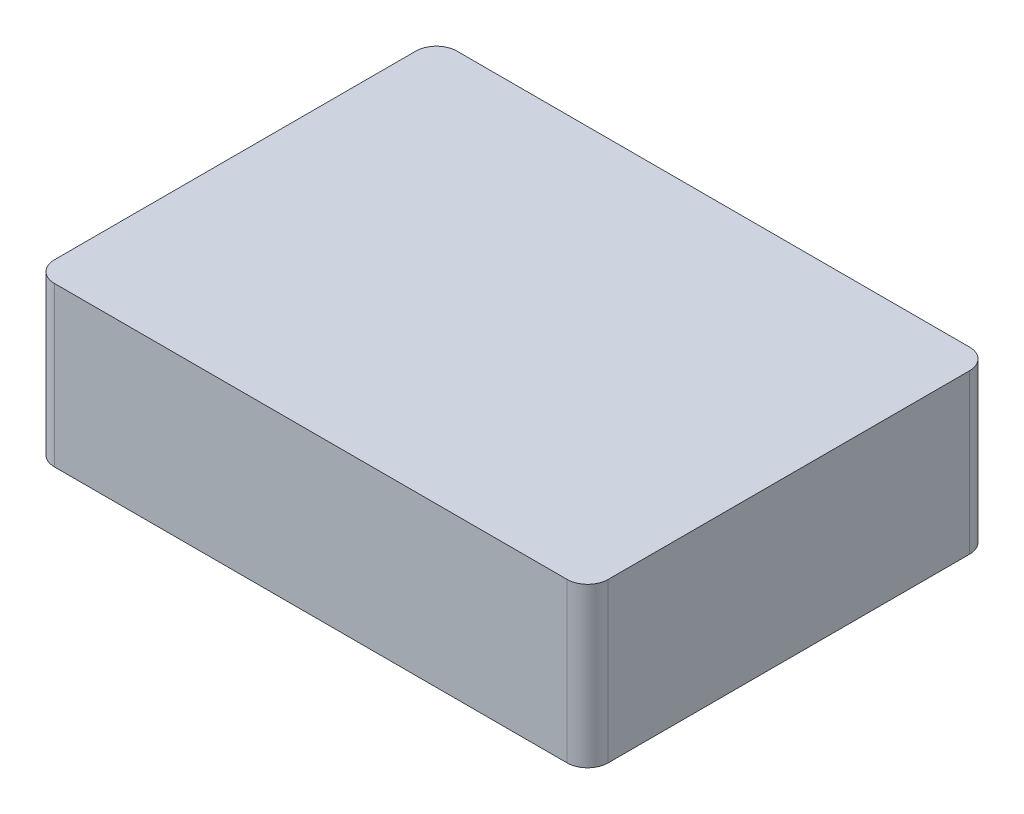
ISO-10303-21;
HEADER;
FILE_DESCRIPTION(('STEP AP214'),'2;1');
FILE_NAME('part.step','',(''),(''),'','','');
FILE_SCHEMA(('AUTOMOTIVE_DESIGN { 1 0 10303 214 1 1 1 1 }'));
ENDSEC;
DATA;
#1=APPLICATION_CONTEXT('core data for automotive mechanical design processes');
#2=APPLICATION_PROTOCOL_DEFINITION('international standard','automotive_design',2000,#1);
#3=PRODUCT_CONTEXT('',#1,'mechanical');
#4=PRODUCT('Part','Part','',(#3));
#5=PRODUCT_RELATED_PRODUCT_CATEGORY('part','',(#4));
#6=PRODUCT_DEFINITION_FORMATION('','',#4);
#7=PRODUCT_DEFINITION_CONTEXT('part definition',#1,'design');
#8=PRODUCT_DEFINITION('design','',#6,#7);
#9=PRODUCT_DEFINITION_SHAPE('','',#8);
#10=(LENGTH_UNIT() NAMED_UNIT(*) SI_UNIT(.MILLI.,.METRE.));
#11=(NAMED_UNIT(*) PLANE_ANGLE_UNIT() SI_UNIT($,.RADIAN.));
#12=(NAMED_UNIT(*) SI_UNIT($,.STERADIAN.) SOLID_ANGLE_UNIT());
#13=UNCERTAINTY_MEASURE_WITH_UNIT(LENGTH_MEASURE(1.E-05),#10,'distance_accuracy_value','');
#14=(GEOMETRIC_REPRESENTATION_CONTEXT(3) GLOBAL_UNCERTAINTY_ASSIGNED_CONTEXT((#13)) GLOBAL_UNIT_ASSIGNED_CONTEXT((#10,
#11,#12)) REPRESENTATION_CONTEXT('',''));
#15=CARTESIAN_POINT('',(0.,0.,0.));
#16=DIRECTION('',(0.,0.,1.));
#17=DIRECTION('',(1.,0.,0.));
#18=AXIS2_PLACEMENT_3D('',#15,#16,#17);
#19=CARTESIAN_POINT('',(0.,15.5,0.));
#20=DIRECTION('',(1.,0.,0.));
#21=DIRECTION('',(0.,0.,-1.));
#22=AXIS2_PLACEMENT_3D('',#19,#20,#21);
#23=PLANE('',#22);
#24=DIRECTION('',(0.,0.,1.));
#25=VECTOR('',#24,1.);
#26=CARTESIAN_POINT('',(0.,15.5,0.));
#27=LINE('',#26,#25);
#28=CARTESIAN_POINT('',(0.,15.5,-37.25));
#29=VERTEX_POINT('',#28);
#30=CARTESIAN_POINT('',(0.,15.5,-2.));
#31=VERTEX_POINT('',#30);
#32=EDGE_CURVE('E131',#29,#31,#27,.T.);
#33=ORIENTED_EDGE('',*,*,#32,.F.);
#34=DIRECTION('',(0.,-1.,0.));
#35=VECTOR('',#34,1.);
#36=CARTESIAN_POINT('',(0.,15.5,-37.25));
#37=LINE('',#36,#35);
#38=CARTESIAN_POINT('',(0.,0.,-37.25));
#39=VERTEX_POINT('',#38);
#40=EDGE_CURVE('E11',#29,#39,#37,.T.);
#41=ORIENTED_EDGE('',*,*,#40,.T.);
#42=DIRECTION('',(0.,0.,1.));
#43=VECTOR('',#42,1.);
#44=CARTESIAN_POINT('',(0.,0.,0.));
#45=LINE('',#44,#43);
#46=CARTESIAN_POINT('',(0.,0.,-2.));
#47=VERTEX_POINT('',#46);
#48=EDGE_CURVE('E122',#39,#47,#45,.T.);
#49=ORIENTED_EDGE('',*,*,#48,.T.);
#50=DIRECTION('',(0.,-1.,0.));
#51=VECTOR('',#50,1.);
#52=CARTESIAN_POINT('',(0.,15.5,-2.));
#53=LINE('',#52,#51);
#54=EDGE_CURVE('E107',#47,#31,#53,.F.);
#55=ORIENTED_EDGE('',*,*,#54,.T.);
#56=EDGE_LOOP('',(#33,#41,#49,#55));
#57=FACE_BOUND('',#56,.T.);
#58=ADVANCED_FACE('F33',(#57),#23,.F.);
#59=CARTESIAN_POINT('',(0.,15.5,0.));
#60=DIRECTION('',(0.,0.,-1.));
#61=DIRECTION('',(-1.,0.,0.));
#62=AXIS2_PLACEMENT_3D('',#59,#60,#61);
#63=PLANE('',#62);
#64=DIRECTION('',(1.,0.,0.));
#65=VECTOR('',#64,1.);
#66=CARTESIAN_POINT('',(0.,0.,0.));
#67=LINE('',#66,#65);
#68=CARTESIAN_POINT('',(2.,0.,0.));
#69=VERTEX_POINT('',#68);
#70=CARTESIAN_POINT('',(52.,0.,0.));
#71=VERTEX_POINT('',#70);
#72=EDGE_CURVE('E113',#69,#71,#67,.T.);
#73=ORIENTED_EDGE('',*,*,#72,.T.);
#74=DIRECTION('',(0.,-1.,0.));
#75=VECTOR('',#74,1.);
#76=CARTESIAN_POINT('',(52.,15.5,0.));
#77=LINE('',#76,#75);
#78=CARTESIAN_POINT('',(52.,15.5,0.));
#79=VERTEX_POINT('',#78);
#80=EDGE_CURVE('E41',#71,#79,#77,.F.);
#81=ORIENTED_EDGE('',*,*,#80,.T.);
#82=DIRECTION('',(1.,0.,0.));
#83=VECTOR('',#82,1.);
#84=CARTESIAN_POINT('',(0.,15.5,0.));
#85=LINE('',#84,#83);
#86=CARTESIAN_POINT('',(2.,15.5,0.));
#87=VERTEX_POINT('',#86);
#88=EDGE_CURVE('E114',#87,#79,#85,.T.);
#89=ORIENTED_EDGE('',*,*,#88,.F.);
#90=DIRECTION('',(0.,-1.,0.));
#91=VECTOR('',#90,1.);
#92=CARTESIAN_POINT('',(2.,15.5,0.));
#93=LINE('',#92,#91);
#94=EDGE_CURVE('E105',#87,#69,#93,.T.);
#95=ORIENTED_EDGE('',*,*,#94,.T.);
#96=EDGE_LOOP('',(#73,#81,#89,#95));
#97=FACE_BOUND('',#96,.T.);
#98=ADVANCED_FACE('F112',(#97),#63,.F.);
#99=CARTESIAN_POINT('',(54.,15.5,0.));
#100=DIRECTION('',(-1.,0.,0.));
#101=DIRECTION('',(0.,0.,1.));
#102=AXIS2_PLACEMENT_3D('',#99,#100,#101);
#103=PLANE('',#102);
#104=DIRECTION('',(0.,0.,-1.));
#105=VECTOR('',#104,1.);
#106=CARTESIAN_POINT('',(54.,0.,0.));
#107=LINE('',#106,#105);
#108=CARTESIAN_POINT('',(54.,0.,-2.));
#109=VERTEX_POINT('',#108);
#110=CARTESIAN_POINT('',(54.,0.,-37.25));
#111=VERTEX_POINT('',#110);
#112=EDGE_CURVE('E121',#109,#111,#107,.T.);
#113=ORIENTED_EDGE('',*,*,#112,.T.);
#114=DIRECTION('',(0.,-1.,0.));
#115=VECTOR('',#114,1.);
#116=CARTESIAN_POINT('',(54.,15.5,-37.25));
#117=LINE('',#116,#115);
#118=CARTESIAN_POINT('',(54.,15.5,-37.25));
#119=VERTEX_POINT('',#118);
#120=EDGE_CURVE('E149',#111,#119,#117,.F.);
#121=ORIENTED_EDGE('',*,*,#120,.T.);
#122=DIRECTION('',(0.,0.,-1.));
#123=VECTOR('',#122,1.);
#124=CARTESIAN_POINT('',(54.,15.5,0.));
#125=LINE('',#124,#123);
#126=CARTESIAN_POINT('',(54.,15.5,-2.));
#127=VERTEX_POINT('',#126);
#128=EDGE_CURVE('E160',#127,#119,#125,.T.);
#129=ORIENTED_EDGE('',*,*,#128,.F.);
#130=DIRECTION('',(0.,-1.,0.));
#131=VECTOR('',#130,1.);
#132=CARTESIAN_POINT('',(54.,15.5,-2.));
#133=LINE('',#132,#131);
#134=EDGE_CURVE('E146',#127,#109,#133,.T.);
#135=ORIENTED_EDGE('',*,*,#134,.T.);
#136=EDGE_LOOP('',(#113,#121,#129,#135));
#137=FACE_BOUND('',#136,.T.);
#138=ADVANCED_FACE('F169',(#137),#103,.F.);
#139=CARTESIAN_POINT('',(0.,15.5,-39.25));
#140=DIRECTION('',(0.,0.,1.));
#141=DIRECTION('',(1.,0.,0.));
#142=AXIS2_PLACEMENT_3D('',#139,#140,#141);
#143=PLANE('',#142);
#144=DIRECTION('',(-1.,0.,0.));
#145=VECTOR('',#144,1.);
#146=CARTESIAN_POINT('',(0.,15.5,-39.25));
#147=LINE('',#146,#145);
#148=CARTESIAN_POINT('',(52.,15.5,-39.25));
#149=VERTEX_POINT('',#148);
#150=CARTESIAN_POINT('',(2.,15.5,-39.25));
#151=VERTEX_POINT('',#150);
#152=EDGE_CURVE('E115',#149,#151,#147,.T.);
#153=ORIENTED_EDGE('',*,*,#152,.F.);
#154=DIRECTION('',(0.,-1.,0.));
#155=VECTOR('',#154,1.);
#156=CARTESIAN_POINT('',(52.,15.5,-39.25));
#157=LINE('',#156,#155);
#158=CARTESIAN_POINT('',(52.,0.,-39.25));
#159=VERTEX_POINT('',#158);
#160=EDGE_CURVE('E138',#149,#159,#157,.T.);
#161=ORIENTED_EDGE('',*,*,#160,.T.);
#162=DIRECTION('',(-1.,0.,0.));
#163=VECTOR('',#162,1.);
#164=CARTESIAN_POINT('',(0.,0.,-39.25));
#165=LINE('',#164,#163);
#166=CARTESIAN_POINT('',(2.,0.,-39.25));
#167=VERTEX_POINT('',#166);
#168=EDGE_CURVE('E125',#159,#167,#165,.T.);
#169=ORIENTED_EDGE('',*,*,#168,.T.);
#170=DIRECTION('',(0.,-1.,0.));
#171=VECTOR('',#170,1.);
#172=CARTESIAN_POINT('',(2.,15.5,-39.25));
#173=LINE('',#172,#171);
#174=EDGE_CURVE('E136',#167,#151,#173,.F.);
#175=ORIENTED_EDGE('',*,*,#174,.T.);
#176=EDGE_LOOP('',(#153,#161,#169,#175));
#177=FACE_BOUND('',#176,.T.);
#178=ADVANCED_FACE('F165',(#177),#143,.F.);
#179=CARTESIAN_POINT('',(0.,15.5,0.));
#180=DIRECTION('',(0.,-1.,0.));
#181=DIRECTION('',(0.,0.,-1.));
#182=AXIS2_PLACEMENT_3D('',#179,#180,#181);
#183=PLANE('',#182);
#184=ORIENTED_EDGE('',*,*,#128,.T.);
#185=CARTESIAN_POINT('',(52.,15.5,-37.25));
#186=DIRECTION('',(0.,-1.,0.));
#187=DIRECTION('',(0.,0.,-1.));
#188=AXIS2_PLACEMENT_3D('',#185,#186,#187);
#189=CIRCLE('',#188,2.);
#190=EDGE_CURVE('E154',#119,#149,#189,.F.);
#191=ORIENTED_EDGE('',*,*,#190,.T.);
#192=ORIENTED_EDGE('',*,*,#152,.T.);
#193=CARTESIAN_POINT('',(2.,15.5,-37.25));
#194=DIRECTION('',(0.,-1.,0.));
#195=DIRECTION('',(0.,0.,-1.));
#196=AXIS2_PLACEMENT_3D('',#193,#194,#195);
#197=CIRCLE('',#196,2.);
#198=EDGE_CURVE('E55',#151,#29,#197,.F.);
#199=ORIENTED_EDGE('',*,*,#198,.T.);
#200=ORIENTED_EDGE('',*,*,#32,.T.);
#201=CARTESIAN_POINT('',(2.,15.5,-2.));
#202=DIRECTION('',(0.,-1.,0.));
#203=DIRECTION('',(0.,0.,-1.));
#204=AXIS2_PLACEMENT_3D('',#201,#202,#203);
#205=CIRCLE('',#204,2.);
#206=EDGE_CURVE('E134',#31,#87,#205,.F.);
#207=ORIENTED_EDGE('',*,*,#206,.T.);
#208=ORIENTED_EDGE('',*,*,#88,.T.);
#209=CARTESIAN_POINT('',(52.,15.5,-2.));
#210=DIRECTION('',(0.,-1.,0.));
#211=DIRECTION('',(0.,0.,-1.));
#212=AXIS2_PLACEMENT_3D('',#209,#210,#211);
#213=CIRCLE('',#212,2.);
#214=EDGE_CURVE('E152',#79,#127,#213,.F.);
#215=ORIENTED_EDGE('',*,*,#214,.T.);
#216=EDGE_LOOP('',(#184,#191,#192,#199,#200,#207,#208,#215));
#217=FACE_BOUND('',#216,.T.);
#218=ADVANCED_FACE('F158',(#217),#183,.F.);
#219=CARTESIAN_POINT('',(0.,0.,0.));
#220=DIRECTION('',(0.,-1.,0.));
#221=DIRECTION('',(0.,0.,-1.));
#222=AXIS2_PLACEMENT_3D('',#219,#220,#221);
#223=PLANE('',#222);
#224=ORIENTED_EDGE('',*,*,#168,.F.);
#225=CARTESIAN_POINT('',(52.,0.,-37.25));
#226=DIRECTION('',(0.,-1.,0.));
#227=DIRECTION('',(0.,0.,-1.));
#228=AXIS2_PLACEMENT_3D('',#225,#226,#227);
#229=CIRCLE('',#228,2.);
#230=EDGE_CURVE('E144',#159,#111,#229,.T.);
#231=ORIENTED_EDGE('',*,*,#230,.T.);
#232=ORIENTED_EDGE('',*,*,#112,.F.);
#233=CARTESIAN_POINT('',(52.,0.,-2.));
#234=DIRECTION('',(0.,-1.,0.));
#235=DIRECTION('',(0.,0.,-1.));
#236=AXIS2_PLACEMENT_3D('',#233,#234,#235);
#237=CIRCLE('',#236,2.);
#238=EDGE_CURVE('E120',#109,#71,#237,.T.);
#239=ORIENTED_EDGE('',*,*,#238,.T.);
#240=ORIENTED_EDGE('',*,*,#72,.F.);
#241=CARTESIAN_POINT('',(2.,0.,-2.));
#242=DIRECTION('',(0.,-1.,0.));
#243=DIRECTION('',(0.,0.,-1.));
#244=AXIS2_PLACEMENT_3D('',#241,#242,#243);
#245=CIRCLE('',#244,2.);
#246=EDGE_CURVE('E101',#69,#47,#245,.T.);
#247=ORIENTED_EDGE('',*,*,#246,.T.);
#248=ORIENTED_EDGE('',*,*,#48,.F.);
#249=CARTESIAN_POINT('',(2.,0.,-37.25));
#250=DIRECTION('',(0.,-1.,0.));
#251=DIRECTION('',(0.,0.,-1.));
#252=AXIS2_PLACEMENT_3D('',#249,#250,#251);
#253=CIRCLE('',#252,2.);
#254=EDGE_CURVE('E141',#39,#167,#253,.T.);
#255=ORIENTED_EDGE('',*,*,#254,.T.);
#256=EDGE_LOOP('',(#224,#231,#232,#239,#240,#247,#248,#255));
#257=FACE_BOUND('',#256,.T.);
#258=ADVANCED_FACE('F118',(#257),#223,.T.);
#259=CARTESIAN_POINT('',(2.,15.5,-2.));
#260=DIRECTION('',(0.,-1.,0.));
#261=DIRECTION('',(0.,0.,-1.));
#262=AXIS2_PLACEMENT_3D('',#259,#260,#261);
#263=CYLINDRICAL_SURFACE('',#262,2.);
#264=ORIENTED_EDGE('',*,*,#206,.F.);
#265=ORIENTED_EDGE('',*,*,#54,.F.);
#266=ORIENTED_EDGE('',*,*,#246,.F.);
#267=ORIENTED_EDGE('',*,*,#94,.F.);
#268=EDGE_LOOP('',(#264,#265,#266,#267));
#269=FACE_BOUND('',#268,.T.);
#270=ADVANCED_FACE('F104',(#269),#263,.T.);
#271=CARTESIAN_POINT('',(52.,15.5,-37.25));
#272=DIRECTION('',(0.,-1.,0.));
#273=DIRECTION('',(0.,0.,-1.));
#274=AXIS2_PLACEMENT_3D('',#271,#272,#273);
#275=CYLINDRICAL_SURFACE('',#274,2.);
#276=ORIENTED_EDGE('',*,*,#190,.F.);
#277=ORIENTED_EDGE('',*,*,#120,.F.);
#278=ORIENTED_EDGE('',*,*,#230,.F.);
#279=ORIENTED_EDGE('',*,*,#160,.F.);
#280=EDGE_LOOP('',(#276,#277,#278,#279));
#281=FACE_BOUND('',#280,.T.);
#282=ADVANCED_FACE('F167',(#281),#275,.T.);
#283=CARTESIAN_POINT('',(52.,15.5,-2.));
#284=DIRECTION('',(0.,-1.,0.));
#285=DIRECTION('',(0.,0.,-1.));
#286=AXIS2_PLACEMENT_3D('',#283,#284,#285);
#287=CYLINDRICAL_SURFACE('',#286,2.);
#288=ORIENTED_EDGE('',*,*,#214,.F.);
#289=ORIENTED_EDGE('',*,*,#80,.F.);
#290=ORIENTED_EDGE('',*,*,#238,.F.);
#291=ORIENTED_EDGE('',*,*,#134,.F.);
#292=EDGE_LOOP('',(#288,#289,#290,#291));
#293=FACE_BOUND('',#292,.T.);
#294=ADVANCED_FACE('F173',(#293),#287,.T.);
#295=CARTESIAN_POINT('',(2.,15.5,-37.25));
#296=DIRECTION('',(0.,-1.,0.));
#297=DIRECTION('',(0.,0.,-1.));
#298=AXIS2_PLACEMENT_3D('',#295,#296,#297);
#299=CYLINDRICAL_SURFACE('',#298,2.);
#300=ORIENTED_EDGE('',*,*,#198,.F.);
#301=ORIENTED_EDGE('',*,*,#174,.F.);
#302=ORIENTED_EDGE('',*,*,#254,.F.);
#303=ORIENTED_EDGE('',*,*,#40,.F.);
#304=EDGE_LOOP('',(#300,#301,#302,#303));
#305=FACE_BOUND('',#304,.T.);
#306=ADVANCED_FACE('F35',(#305),#299,.T.);
#307=CLOSED_SHELL('',(#58,#98,#138,#178,#218,#258,#270,#282,#294,#306));
#308=MANIFOLD_SOLID_BREP('B2',#307);
#309=ADVANCED_BREP_SHAPE_REPRESENTATION('',(#18,#308),#14);
#310=SHAPE_DEFINITION_REPRESENTATION(#9,#309);
ENDSEC;
END-ISO-10303-21;
